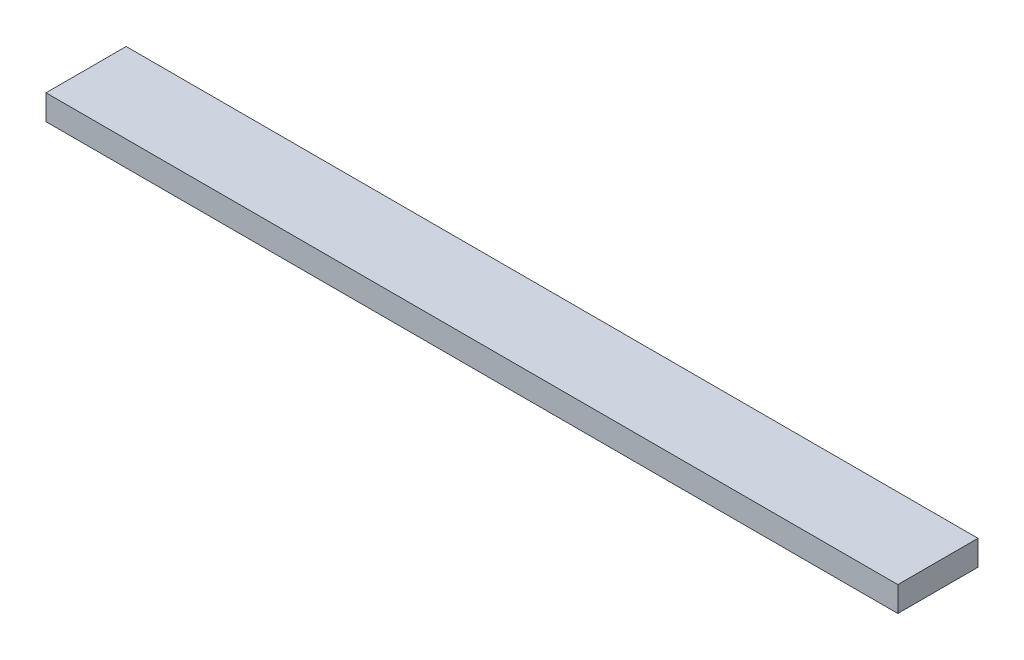
ISO-10303-21;
HEADER;
FILE_DESCRIPTION(('STEP AP214'),'2;1');
FILE_NAME('part.step','',(''),(''),'','','');
FILE_SCHEMA(('AUTOMOTIVE_DESIGN { 1 0 10303 214 1 1 1 1 }'));
ENDSEC;
DATA;
#1=APPLICATION_CONTEXT('core data for automotive mechanical design processes');
#2=APPLICATION_PROTOCOL_DEFINITION('international standard','automotive_design',2000,#1);
#3=PRODUCT_CONTEXT('',#1,'mechanical');
#4=PRODUCT('Part','Part','',(#3));
#5=PRODUCT_RELATED_PRODUCT_CATEGORY('part','',(#4));
#6=PRODUCT_DEFINITION_FORMATION('','',#4);
#7=PRODUCT_DEFINITION_CONTEXT('part definition',#1,'design');
#8=PRODUCT_DEFINITION('design','',#6,#7);
#9=PRODUCT_DEFINITION_SHAPE('','',#8);
#10=(LENGTH_UNIT() NAMED_UNIT(*) SI_UNIT(.MILLI.,.METRE.));
#11=(NAMED_UNIT(*) PLANE_ANGLE_UNIT() SI_UNIT($,.RADIAN.));
#12=(NAMED_UNIT(*) SI_UNIT($,.STERADIAN.) SOLID_ANGLE_UNIT());
#13=UNCERTAINTY_MEASURE_WITH_UNIT(LENGTH_MEASURE(1.E-05),#10,'distance_accuracy_value','');
#14=(GEOMETRIC_REPRESENTATION_CONTEXT(3) GLOBAL_UNCERTAINTY_ASSIGNED_CONTEXT((#13)) GLOBAL_UNIT_ASSIGNED_CONTEXT((#10,
#11,#12)) REPRESENTATION_CONTEXT('',''));
#15=CARTESIAN_POINT('',(0.,0.,0.));
#16=DIRECTION('',(0.,0.,1.));
#17=DIRECTION('',(1.,0.,0.));
#18=AXIS2_PLACEMENT_3D('',#15,#16,#17);
#19=CARTESIAN_POINT('',(849.999999999999,12.5,-40.));
#20=DIRECTION('',(0.,0.,1.));
#21=DIRECTION('',(1.,0.,0.));
#22=AXIS2_PLACEMENT_3D('',#19,#20,#21);
#23=PLANE('',#22);
#24=DIRECTION('',(0.,1.,0.));
#25=VECTOR('',#24,1.);
#26=CARTESIAN_POINT('',(0.,12.5,-40.));
#27=LINE('',#26,#25);
#28=CARTESIAN_POINT('',(0.,-12.5,-40.));
#29=VERTEX_POINT('',#28);
#30=CARTESIAN_POINT('',(0.,12.5,-40.));
#31=VERTEX_POINT('',#30);
#32=EDGE_CURVE('E100',#29,#31,#27,.T.);
#33=ORIENTED_EDGE('',*,*,#32,.T.);
#34=DIRECTION('',(-1.,0.,0.));
#35=VECTOR('',#34,1.);
#36=CARTESIAN_POINT('',(849.999999999999,12.5,-40.));
#37=LINE('',#36,#35);
#38=CARTESIAN_POINT('',(849.999999999999,12.5,-40.));
#39=VERTEX_POINT('',#38);
#40=EDGE_CURVE('E11',#39,#31,#37,.T.);
#41=ORIENTED_EDGE('',*,*,#40,.F.);
#42=DIRECTION('',(0.,1.,0.));
#43=VECTOR('',#42,1.);
#44=CARTESIAN_POINT('',(849.999999999999,12.5,-40.));
#45=LINE('',#44,#43);
#46=CARTESIAN_POINT('',(849.999999999999,-12.5,-40.));
#47=VERTEX_POINT('',#46);
#48=EDGE_CURVE('E88',#47,#39,#45,.T.);
#49=ORIENTED_EDGE('',*,*,#48,.F.);
#50=DIRECTION('',(-1.,0.,0.));
#51=VECTOR('',#50,1.);
#52=CARTESIAN_POINT('',(849.999999999999,-12.5,-40.));
#53=LINE('',#52,#51);
#54=EDGE_CURVE('E96',#47,#29,#53,.T.);
#55=ORIENTED_EDGE('',*,*,#54,.T.);
#56=EDGE_LOOP('',(#33,#41,#49,#55));
#57=FACE_BOUND('',#56,.T.);
#58=ADVANCED_FACE('F37',(#57),#23,.F.);
#59=CARTESIAN_POINT('',(849.999999999999,12.5,40.));
#60=DIRECTION('',(0.,-1.,0.));
#61=DIRECTION('',(0.,0.,-1.));
#62=AXIS2_PLACEMENT_3D('',#59,#60,#61);
#63=PLANE('',#62);
#64=DIRECTION('',(0.,0.,1.));
#65=VECTOR('',#64,1.);
#66=CARTESIAN_POINT('',(0.,12.5,40.));
#67=LINE('',#66,#65);
#68=CARTESIAN_POINT('',(0.,12.5,40.));
#69=VERTEX_POINT('',#68);
#70=EDGE_CURVE('E92',#31,#69,#67,.T.);
#71=ORIENTED_EDGE('',*,*,#70,.T.);
#72=DIRECTION('',(-1.,0.,0.));
#73=VECTOR('',#72,1.);
#74=CARTESIAN_POINT('',(849.999999999999,12.5,40.));
#75=LINE('',#74,#73);
#76=CARTESIAN_POINT('',(849.999999999999,12.5,40.));
#77=VERTEX_POINT('',#76);
#78=EDGE_CURVE('E45',#77,#69,#75,.T.);
#79=ORIENTED_EDGE('',*,*,#78,.F.);
#80=DIRECTION('',(0.,0.,1.));
#81=VECTOR('',#80,1.);
#82=CARTESIAN_POINT('',(849.999999999999,12.5,40.));
#83=LINE('',#82,#81);
#84=EDGE_CURVE('E83',#39,#77,#83,.T.);
#85=ORIENTED_EDGE('',*,*,#84,.F.);
#86=ORIENTED_EDGE('',*,*,#40,.T.);
#87=EDGE_LOOP('',(#71,#79,#85,#86));
#88=FACE_BOUND('',#87,.T.);
#89=ADVANCED_FACE('F91',(#88),#63,.F.);
#90=CARTESIAN_POINT('',(849.999999999999,12.5,40.));
#91=DIRECTION('',(0.,0.,-1.));
#92=DIRECTION('',(-1.,0.,0.));
#93=AXIS2_PLACEMENT_3D('',#90,#91,#92);
#94=PLANE('',#93);
#95=DIRECTION('',(0.,-1.,0.));
#96=VECTOR('',#95,1.);
#97=CARTESIAN_POINT('',(0.,12.5,40.));
#98=LINE('',#97,#96);
#99=CARTESIAN_POINT('',(0.,-12.5,40.));
#100=VERTEX_POINT('',#99);
#101=EDGE_CURVE('E70',#69,#100,#98,.T.);
#102=ORIENTED_EDGE('',*,*,#101,.T.);
#103=DIRECTION('',(-1.,0.,0.));
#104=VECTOR('',#103,1.);
#105=CARTESIAN_POINT('',(849.999999999999,-12.5,40.));
#106=LINE('',#105,#104);
#107=CARTESIAN_POINT('',(849.999999999999,-12.5,40.));
#108=VERTEX_POINT('',#107);
#109=EDGE_CURVE('E93',#108,#100,#106,.T.);
#110=ORIENTED_EDGE('',*,*,#109,.F.);
#111=DIRECTION('',(0.,-1.,0.));
#112=VECTOR('',#111,1.);
#113=CARTESIAN_POINT('',(849.999999999999,12.5,40.));
#114=LINE('',#113,#112);
#115=EDGE_CURVE('E86',#77,#108,#114,.T.);
#116=ORIENTED_EDGE('',*,*,#115,.F.);
#117=ORIENTED_EDGE('',*,*,#78,.T.);
#118=EDGE_LOOP('',(#102,#110,#116,#117));
#119=FACE_BOUND('',#118,.T.);
#120=ADVANCED_FACE('F94',(#119),#94,.F.);
#121=CARTESIAN_POINT('',(849.999999999999,-12.5,40.));
#122=DIRECTION('',(0.,1.,0.));
#123=DIRECTION('',(0.,0.,1.));
#124=AXIS2_PLACEMENT_3D('',#121,#122,#123);
#125=PLANE('',#124);
#126=DIRECTION('',(0.,0.,-1.));
#127=VECTOR('',#126,1.);
#128=CARTESIAN_POINT('',(0.,-12.5,40.));
#129=LINE('',#128,#127);
#130=EDGE_CURVE('E76',#100,#29,#129,.T.);
#131=ORIENTED_EDGE('',*,*,#130,.T.);
#132=ORIENTED_EDGE('',*,*,#54,.F.);
#133=DIRECTION('',(0.,0.,-1.));
#134=VECTOR('',#133,1.);
#135=CARTESIAN_POINT('',(849.999999999999,-12.5,40.));
#136=LINE('',#135,#134);
#137=EDGE_CURVE('E53',#108,#47,#136,.T.);
#138=ORIENTED_EDGE('',*,*,#137,.F.);
#139=ORIENTED_EDGE('',*,*,#109,.T.);
#140=EDGE_LOOP('',(#131,#132,#138,#139));
#141=FACE_BOUND('',#140,.T.);
#142=ADVANCED_FACE('F107',(#141),#125,.F.);
#143=CARTESIAN_POINT('',(849.999999999999,0.,0.));
#144=DIRECTION('',(1.,0.,0.));
#145=DIRECTION('',(0.,0.,-1.));
#146=AXIS2_PLACEMENT_3D('',#143,#144,#145);
#147=PLANE('',#146);
#148=ORIENTED_EDGE('',*,*,#48,.T.);
#149=ORIENTED_EDGE('',*,*,#84,.T.);
#150=ORIENTED_EDGE('',*,*,#115,.T.);
#151=ORIENTED_EDGE('',*,*,#137,.T.);
#152=EDGE_LOOP('',(#148,#149,#150,#151));
#153=FACE_BOUND('',#152,.T.);
#154=ADVANCED_FACE('F84',(#153),#147,.T.);
#155=CARTESIAN_POINT('',(0.,0.,0.));
#156=DIRECTION('',(1.,0.,0.));
#157=DIRECTION('',(0.,0.,-1.));
#158=AXIS2_PLACEMENT_3D('',#155,#156,#157);
#159=PLANE('',#158);
#160=ORIENTED_EDGE('',*,*,#32,.F.);
#161=ORIENTED_EDGE('',*,*,#130,.F.);
#162=ORIENTED_EDGE('',*,*,#101,.F.);
#163=ORIENTED_EDGE('',*,*,#70,.F.);
#164=EDGE_LOOP('',(#160,#161,#162,#163));
#165=FACE_BOUND('',#164,.T.);
#166=ADVANCED_FACE('F110',(#165),#159,.F.);
#167=CLOSED_SHELL('',(#58,#89,#120,#142,#154,#166));
#168=MANIFOLD_SOLID_BREP('B2',#167);
#169=ADVANCED_BREP_SHAPE_REPRESENTATION('',(#18,#168),#14);
#170=SHAPE_DEFINITION_REPRESENTATION(#9,#169);
ENDSEC;
END-ISO-10303-21;
